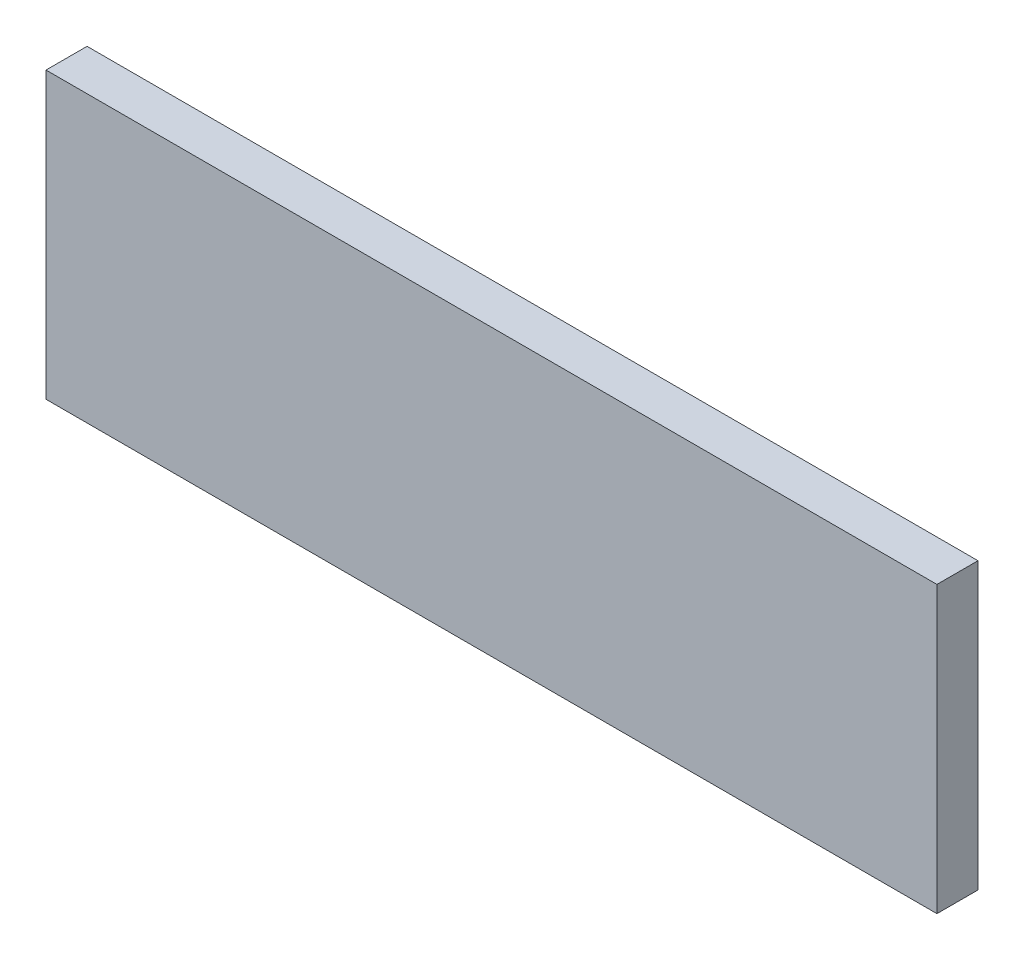
ISO-10303-21;
HEADER;
FILE_DESCRIPTION(('STEP AP214'),'2;1');
FILE_NAME('part.step','',(''),(''),'','','');
FILE_SCHEMA(('AUTOMOTIVE_DESIGN { 1 0 10303 214 1 1 1 1 }'));
ENDSEC;
DATA;
#1=APPLICATION_CONTEXT('core data for automotive mechanical design processes');
#2=APPLICATION_PROTOCOL_DEFINITION('international standard','automotive_design',2000,#1);
#3=PRODUCT_CONTEXT('',#1,'mechanical');
#4=PRODUCT('Part','Part','',(#3));
#5=PRODUCT_RELATED_PRODUCT_CATEGORY('part','',(#4));
#6=PRODUCT_DEFINITION_FORMATION('','',#4);
#7=PRODUCT_DEFINITION_CONTEXT('part definition',#1,'design');
#8=PRODUCT_DEFINITION('design','',#6,#7);
#9=PRODUCT_DEFINITION_SHAPE('','',#8);
#10=(LENGTH_UNIT() NAMED_UNIT(*) SI_UNIT(.MILLI.,.METRE.));
#11=(NAMED_UNIT(*) PLANE_ANGLE_UNIT() SI_UNIT($,.RADIAN.));
#12=(NAMED_UNIT(*) SI_UNIT($,.STERADIAN.) SOLID_ANGLE_UNIT());
#13=UNCERTAINTY_MEASURE_WITH_UNIT(LENGTH_MEASURE(1.E-05),#10,'distance_accuracy_value','');
#14=(GEOMETRIC_REPRESENTATION_CONTEXT(3) GLOBAL_UNCERTAINTY_ASSIGNED_CONTEXT((#13)) GLOBAL_UNIT_ASSIGNED_CONTEXT((#10,
#11,#12)) REPRESENTATION_CONTEXT('',''));
#15=CARTESIAN_POINT('',(0.,0.,0.));
#16=DIRECTION('',(0.,0.,1.));
#17=DIRECTION('',(1.,0.,0.));
#18=AXIS2_PLACEMENT_3D('',#15,#16,#17);
#19=CARTESIAN_POINT('',(1.9527647,-0.62500002,0.17999964));
#20=DIRECTION('',(0.,0.,1.));
#21=DIRECTION('',(1.,0.,0.));
#22=AXIS2_PLACEMENT_3D('',#19,#20,#21);
#23=PLANE('',#22);
#24=DIRECTION('',(0.,-1.,0.));
#25=VECTOR('',#24,1.);
#26=CARTESIAN_POINT('',(1.9527647,0.62500002,0.17999964));
#27=LINE('',#26,#25);
#28=CARTESIAN_POINT('',(1.9527647,0.62500002,0.17999964));
#29=VERTEX_POINT('',#28);
#30=CARTESIAN_POINT('',(1.9527647,-0.62500002,0.17999964));
#31=VERTEX_POINT('',#30);
#32=EDGE_CURVE('E28',#29,#31,#27,.T.);
#33=ORIENTED_EDGE('',*,*,#32,.F.);
#34=DIRECTION('',(1.,0.,0.));
#35=VECTOR('',#34,1.);
#36=CARTESIAN_POINT('',(-1.95276216,0.62500002,0.17999964));
#37=LINE('',#36,#35);
#38=CARTESIAN_POINT('',(-1.95276216,0.62500002,0.17999964));
#39=VERTEX_POINT('',#38);
#40=EDGE_CURVE('E21',#39,#29,#37,.T.);
#41=ORIENTED_EDGE('',*,*,#40,.F.);
#42=DIRECTION('',(0.,1.,0.));
#43=VECTOR('',#42,1.);
#44=CARTESIAN_POINT('',(-1.95276216,-0.62500002,0.17999964));
#45=LINE('',#44,#43);
#46=CARTESIAN_POINT('',(-1.95276216,-0.62500002,0.17999964));
#47=VERTEX_POINT('',#46);
#48=EDGE_CURVE('E79',#47,#39,#45,.T.);
#49=ORIENTED_EDGE('',*,*,#48,.F.);
#50=DIRECTION('',(-1.,0.,0.));
#51=VECTOR('',#50,1.);
#52=CARTESIAN_POINT('',(1.9527647,-0.62500002,0.17999964));
#53=LINE('',#52,#51);
#54=EDGE_CURVE('E83',#31,#47,#53,.T.);
#55=ORIENTED_EDGE('',*,*,#54,.F.);
#56=EDGE_LOOP('',(#33,#41,#49,#55));
#57=FACE_BOUND('',#56,.T.);
#58=ADVANCED_FACE('F17',(#57),#23,.T.);
#59=CARTESIAN_POINT('',(1.9527647,-0.62500002,0.));
#60=DIRECTION('',(0.,0.,1.));
#61=DIRECTION('',(1.,0.,0.));
#62=AXIS2_PLACEMENT_3D('',#59,#60,#61);
#63=PLANE('',#62);
#64=DIRECTION('',(-1.,0.,0.));
#65=VECTOR('',#64,1.);
#66=CARTESIAN_POINT('',(1.9527647,-0.62500002,0.));
#67=LINE('',#66,#65);
#68=CARTESIAN_POINT('',(1.9527647,-0.62500002,0.));
#69=VERTEX_POINT('',#68);
#70=CARTESIAN_POINT('',(-1.95276216,-0.62500002,0.));
#71=VERTEX_POINT('',#70);
#72=EDGE_CURVE('E66',#69,#71,#67,.T.);
#73=ORIENTED_EDGE('',*,*,#72,.T.);
#74=DIRECTION('',(0.,1.,0.));
#75=VECTOR('',#74,1.);
#76=CARTESIAN_POINT('',(-1.95276216,-0.62500002,0.));
#77=LINE('',#76,#75);
#78=CARTESIAN_POINT('',(-1.95276216,0.62500002,0.));
#79=VERTEX_POINT('',#78);
#80=EDGE_CURVE('E105',#71,#79,#77,.T.);
#81=ORIENTED_EDGE('',*,*,#80,.T.);
#82=DIRECTION('',(1.,0.,0.));
#83=VECTOR('',#82,1.);
#84=CARTESIAN_POINT('',(-1.95276216,0.62500002,0.));
#85=LINE('',#84,#83);
#86=CARTESIAN_POINT('',(1.9527647,0.62500002,0.));
#87=VERTEX_POINT('',#86);
#88=EDGE_CURVE('E69',#79,#87,#85,.T.);
#89=ORIENTED_EDGE('',*,*,#88,.T.);
#90=DIRECTION('',(0.,-1.,0.));
#91=VECTOR('',#90,1.);
#92=CARTESIAN_POINT('',(1.9527647,0.62500002,0.));
#93=LINE('',#92,#91);
#94=EDGE_CURVE('E11',#87,#69,#93,.T.);
#95=ORIENTED_EDGE('',*,*,#94,.T.);
#96=EDGE_LOOP('',(#73,#81,#89,#95));
#97=FACE_BOUND('',#96,.T.);
#98=ADVANCED_FACE('F19',(#97),#63,.F.);
#99=CARTESIAN_POINT('',(1.9527647,0.62500002,0.));
#100=DIRECTION('',(1.,0.,0.));
#101=DIRECTION('',(0.,1.,0.));
#102=AXIS2_PLACEMENT_3D('',#99,#100,#101);
#103=PLANE('',#102);
#104=DIRECTION('',(0.,0.,1.));
#105=VECTOR('',#104,1.);
#106=CARTESIAN_POINT('',(1.9527647,0.62500002,0.));
#107=LINE('',#106,#105);
#108=EDGE_CURVE('E94',#87,#29,#107,.T.);
#109=ORIENTED_EDGE('',*,*,#108,.T.);
#110=ORIENTED_EDGE('',*,*,#32,.T.);
#111=DIRECTION('',(0.,0.,1.));
#112=VECTOR('',#111,1.);
#113=CARTESIAN_POINT('',(1.9527647,-0.62500002,0.));
#114=LINE('',#113,#112);
#115=EDGE_CURVE('E75',#69,#31,#114,.T.);
#116=ORIENTED_EDGE('',*,*,#115,.F.);
#117=ORIENTED_EDGE('',*,*,#94,.F.);
#118=EDGE_LOOP('',(#109,#110,#116,#117));
#119=FACE_BOUND('',#118,.T.);
#120=ADVANCED_FACE('F81',(#119),#103,.T.);
#121=CARTESIAN_POINT('',(-1.95276216,0.62500002,0.));
#122=DIRECTION('',(0.,1.,0.));
#123=DIRECTION('',(1.,0.,0.));
#124=AXIS2_PLACEMENT_3D('',#121,#122,#123);
#125=PLANE('',#124);
#126=DIRECTION('',(0.,0.,1.));
#127=VECTOR('',#126,1.);
#128=CARTESIAN_POINT('',(-1.95276216,0.62500002,0.));
#129=LINE('',#128,#127);
#130=EDGE_CURVE('E91',#79,#39,#129,.T.);
#131=ORIENTED_EDGE('',*,*,#130,.T.);
#132=ORIENTED_EDGE('',*,*,#40,.T.);
#133=ORIENTED_EDGE('',*,*,#108,.F.);
#134=ORIENTED_EDGE('',*,*,#88,.F.);
#135=EDGE_LOOP('',(#131,#132,#133,#134));
#136=FACE_BOUND('',#135,.T.);
#137=ADVANCED_FACE('F125',(#136),#125,.T.);
#138=CARTESIAN_POINT('',(-1.95276216,-0.62500002,0.));
#139=DIRECTION('',(-1.,0.,0.));
#140=DIRECTION('',(0.,0.,1.));
#141=AXIS2_PLACEMENT_3D('',#138,#139,#140);
#142=PLANE('',#141);
#143=DIRECTION('',(0.,0.,1.));
#144=VECTOR('',#143,1.);
#145=CARTESIAN_POINT('',(-1.95276216,-0.62500002,0.));
#146=LINE('',#145,#144);
#147=EDGE_CURVE('E77',#71,#47,#146,.T.);
#148=ORIENTED_EDGE('',*,*,#147,.T.);
#149=ORIENTED_EDGE('',*,*,#48,.T.);
#150=ORIENTED_EDGE('',*,*,#130,.F.);
#151=ORIENTED_EDGE('',*,*,#80,.F.);
#152=EDGE_LOOP('',(#148,#149,#150,#151));
#153=FACE_BOUND('',#152,.T.);
#154=ADVANCED_FACE('F123',(#153),#142,.T.);
#155=CARTESIAN_POINT('',(1.9527647,-0.62500002,0.));
#156=DIRECTION('',(0.,-1.,0.));
#157=DIRECTION('',(0.,0.,-1.));
#158=AXIS2_PLACEMENT_3D('',#155,#156,#157);
#159=PLANE('',#158);
#160=ORIENTED_EDGE('',*,*,#115,.T.);
#161=ORIENTED_EDGE('',*,*,#54,.T.);
#162=ORIENTED_EDGE('',*,*,#147,.F.);
#163=ORIENTED_EDGE('',*,*,#72,.F.);
#164=EDGE_LOOP('',(#160,#161,#162,#163));
#165=FACE_BOUND('',#164,.T.);
#166=ADVANCED_FACE('F73',(#165),#159,.T.);
#167=CLOSED_SHELL('',(#58,#98,#120,#137,#154,#166));
#168=MANIFOLD_SOLID_BREP('B1',#167);
#169=ADVANCED_BREP_SHAPE_REPRESENTATION('',(#18,#168),#14);
#170=SHAPE_DEFINITION_REPRESENTATION(#9,#169);
ENDSEC;
END-ISO-10303-21;
